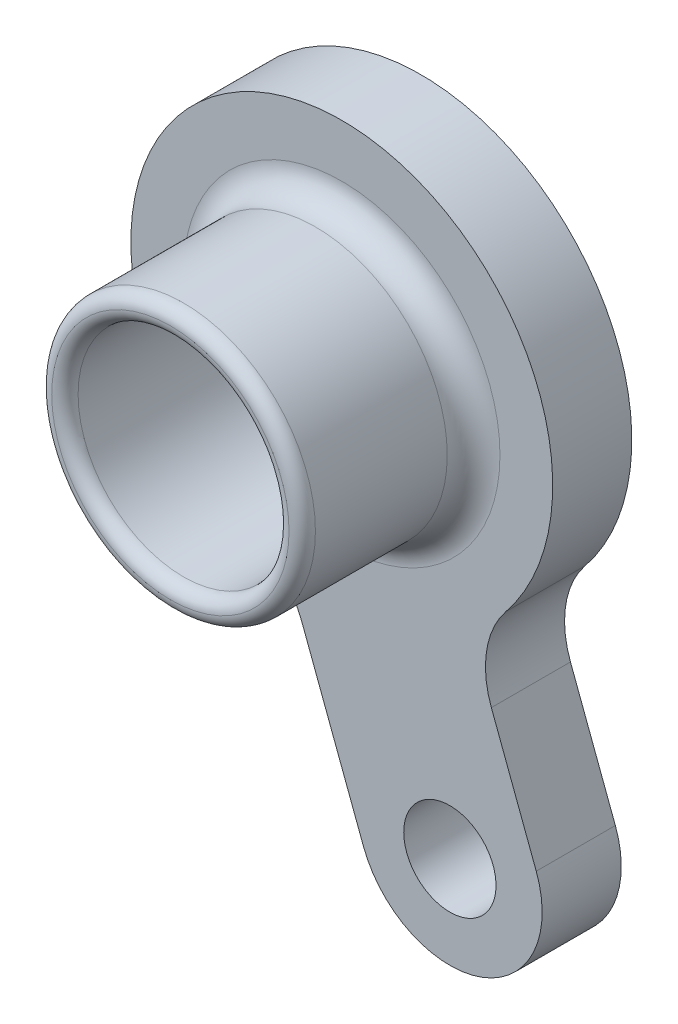
ISO-10303-21;
HEADER;
FILE_DESCRIPTION(('STEP AP214'),'2;1');
FILE_NAME('part.step','',(''),(''),'','','');
FILE_SCHEMA(('AUTOMOTIVE_DESIGN { 1 0 10303 214 1 1 1 1 }'));
ENDSEC;
DATA;
#1=APPLICATION_CONTEXT('core data for automotive mechanical design processes');
#2=APPLICATION_PROTOCOL_DEFINITION('international standard','automotive_design',2000,#1);
#3=PRODUCT_CONTEXT('',#1,'mechanical');
#4=PRODUCT('Part','Part','',(#3));
#5=PRODUCT_RELATED_PRODUCT_CATEGORY('part','',(#4));
#6=PRODUCT_DEFINITION_FORMATION('','',#4);
#7=PRODUCT_DEFINITION_CONTEXT('part definition',#1,'design');
#8=PRODUCT_DEFINITION('design','',#6,#7);
#9=PRODUCT_DEFINITION_SHAPE('','',#8);
#10=(LENGTH_UNIT() NAMED_UNIT(*) SI_UNIT(.MILLI.,.METRE.));
#11=(NAMED_UNIT(*) PLANE_ANGLE_UNIT() SI_UNIT($,.RADIAN.));
#12=(NAMED_UNIT(*) SI_UNIT($,.STERADIAN.) SOLID_ANGLE_UNIT());
#13=UNCERTAINTY_MEASURE_WITH_UNIT(LENGTH_MEASURE(1.E-05),#10,'distance_accuracy_value','');
#14=(GEOMETRIC_REPRESENTATION_CONTEXT(3) GLOBAL_UNCERTAINTY_ASSIGNED_CONTEXT((#13)) GLOBAL_UNIT_ASSIGNED_CONTEXT((#10,
#11,#12)) REPRESENTATION_CONTEXT('',''));
#15=CARTESIAN_POINT('',(0.,0.,0.));
#16=DIRECTION('',(0.,0.,1.));
#17=DIRECTION('',(1.,0.,0.));
#18=AXIS2_PLACEMENT_3D('',#15,#16,#17);
#19=CARTESIAN_POINT('',(0.,0.,3.));
#20=DIRECTION('',(0.,0.,-1.));
#21=DIRECTION('',(-1.,0.,0.));
#22=AXIS2_PLACEMENT_3D('',#19,#20,#21);
#23=CYLINDRICAL_SURFACE('',#22,8.);
#24=CARTESIAN_POINT('',(0.,0.,3.));
#25=DIRECTION('',(0.,0.,1.));
#26=DIRECTION('',(1.,0.,0.));
#27=AXIS2_PLACEMENT_3D('',#24,#25,#26);
#28=CIRCLE('',#27,8.);
#29=CARTESIAN_POINT('',(6.22546666434938,-5.0242974445264,3.));
#30=VERTEX_POINT('',#29);
#31=CARTESIAN_POINT('',(-3.33482549841192,-7.27179062508965,3.));
#32=VERTEX_POINT('',#31);
#33=EDGE_CURVE('E123',#30,#32,#28,.T.);
#34=ORIENTED_EDGE('',*,*,#33,.F.);
#35=DIRECTION('',(0.,0.,-1.));
#36=VECTOR('',#35,1.);
#37=CARTESIAN_POINT('',(6.22546666434938,-5.0242974445264,3.));
#38=LINE('',#37,#36);
#39=CARTESIAN_POINT('',(6.22546666434938,-5.0242974445264,0.));
#40=VERTEX_POINT('',#39);
#41=EDGE_CURVE('E110',#30,#40,#38,.T.);
#42=ORIENTED_EDGE('',*,*,#41,.T.);
#43=CARTESIAN_POINT('',(0.,0.,0.));
#44=DIRECTION('',(0.,0.,1.));
#45=DIRECTION('',(1.,0.,0.));
#46=AXIS2_PLACEMENT_3D('',#43,#44,#45);
#47=CIRCLE('',#46,8.);
#48=CARTESIAN_POINT('',(-3.33482549841192,-7.27179062508965,0.));
#49=VERTEX_POINT('',#48);
#50=EDGE_CURVE('E120',#40,#49,#47,.T.);
#51=ORIENTED_EDGE('',*,*,#50,.T.);
#52=DIRECTION('',(0.,0.,-1.));
#53=VECTOR('',#52,1.);
#54=CARTESIAN_POINT('',(-3.33482549841192,-7.27179062508965,3.));
#55=LINE('',#54,#53);
#56=EDGE_CURVE('E126',#49,#32,#55,.F.);
#57=ORIENTED_EDGE('',*,*,#56,.T.);
#58=EDGE_LOOP('',(#34,#42,#51,#57));
#59=FACE_BOUND('',#58,.T.);
#60=ADVANCED_FACE('F45',(#59),#23,.T.);
#61=CARTESIAN_POINT('',(0.,0.,3.));
#62=DIRECTION('',(0.,0.,-1.));
#63=DIRECTION('',(-1.,0.,0.));
#64=AXIS2_PLACEMENT_3D('',#61,#62,#63);
#65=CYLINDRICAL_SURFACE('',#64,5.);
#66=CARTESIAN_POINT('',(0.,0.,2.25));
#67=DIRECTION('',(0.,0.,1.));
#68=DIRECTION('',(1.,0.,0.));
#69=AXIS2_PLACEMENT_3D('',#66,#67,#68);
#70=CIRCLE('',#69,5.);
#71=CARTESIAN_POINT('',(5.,0.,2.25));
#72=VERTEX_POINT('',#71);
#73=EDGE_CURVE('E154',#72,#72,#70,.T.);
#74=ORIENTED_EDGE('',*,*,#73,.T.);
#75=EDGE_LOOP('',(#74));
#76=FACE_BOUND('',#75,.T.);
#77=CARTESIAN_POINT('',(0.,0.,0.));
#78=DIRECTION('',(0.,0.,1.));
#79=DIRECTION('',(1.,0.,0.));
#80=AXIS2_PLACEMENT_3D('',#77,#78,#79);
#81=CIRCLE('',#80,5.);
#82=CARTESIAN_POINT('',(5.,0.,0.));
#83=VERTEX_POINT('',#82);
#84=EDGE_CURVE('E133',#83,#83,#81,.T.);
#85=ORIENTED_EDGE('',*,*,#84,.F.);
#86=EDGE_LOOP('',(#85));
#87=FACE_BOUND('',#86,.T.);
#88=ADVANCED_FACE('F219',(#76,#87),#65,.F.);
#89=CARTESIAN_POINT('',(0.,0.,3.));
#90=DIRECTION('',(0.,0.,1.));
#91=DIRECTION('',(1.,0.,0.));
#92=AXIS2_PLACEMENT_3D('',#89,#90,#91);
#93=PLANE('',#92);
#94=CARTESIAN_POINT('',(0.,0.,3.));
#95=DIRECTION('',(0.,0.,1.));
#96=DIRECTION('',(1.,0.,0.));
#97=AXIS2_PLACEMENT_3D('',#94,#95,#96);
#98=CIRCLE('',#97,6.);
#99=CARTESIAN_POINT('',(6.,0.,3.));
#100=VERTEX_POINT('',#99);
#101=EDGE_CURVE('E11',#100,#100,#98,.F.);
#102=ORIENTED_EDGE('',*,*,#101,.T.);
#103=EDGE_LOOP('',(#102));
#104=FACE_BOUND('',#103,.T.);
#105=DIRECTION('',(0.352311658541721,-0.935882735846528,0.));
#106=VECTOR('',#105,1.);
#107=CARTESIAN_POINT('',(-4.36985123281011,-1.64502397196093,3.));
#108=LINE('',#107,#106);
#109=CARTESIAN_POINT('',(-1.51822207850429,-9.22010821867035,3.));
#110=VERTEX_POINT('',#109);
#111=CARTESIAN_POINT('',(0.824410424537151,-15.443090804896,3.));
#112=VERTEX_POINT('',#111);
#113=EDGE_CURVE('E278',#110,#112,#108,.T.);
#114=ORIENTED_EDGE('',*,*,#113,.T.);
#115=CARTESIAN_POINT('',(4.1,-14.21,3.));
#116=DIRECTION('',(0.,0.,1.));
#117=DIRECTION('',(1.,0.,0.));
#118=AXIS2_PLACEMENT_3D('',#115,#116,#117);
#119=CIRCLE('',#118,3.5);
#120=CARTESIAN_POINT('',(5.33309080489602,-17.4855895754628,3.));
#121=VERTEX_POINT('',#120);
#122=EDGE_CURVE('E61',#112,#121,#119,.T.);
#123=ORIENTED_EDGE('',*,*,#122,.T.);
#124=CARTESIAN_POINT('',(4.1,-14.21,3.));
#125=DIRECTION('',(0.,0.,1.));
#126=DIRECTION('',(1.,0.,0.));
#127=AXIS2_PLACEMENT_3D('',#124,#125,#126);
#128=CIRCLE('',#127,3.5);
#129=CARTESIAN_POINT('',(7.37558957546285,-12.976909195104,3.));
#130=VERTEX_POINT('',#129);
#131=EDGE_CURVE('E185',#121,#130,#128,.T.);
#132=ORIENTED_EDGE('',*,*,#131,.T.);
#133=DIRECTION('',(-0.352311658541721,0.935882735846528,0.));
#134=VECTOR('',#133,1.);
#135=CARTESIAN_POINT('',(2.18132791811558,0.821157637831119,3.));
#136=LINE('',#135,#134);
#137=CARTESIAN_POINT('',(5.67351875453939,-8.45551838140273,3.));
#138=VERTEX_POINT('',#137);
#139=EDGE_CURVE('E262',#130,#138,#136,.T.);
#140=ORIENTED_EDGE('',*,*,#139,.T.);
#141=CARTESIAN_POINT('',(8.94910833000224,-7.22242757650671,3.));
#142=DIRECTION('',(0.,0.,1.));
#143=DIRECTION('',(1.,0.,0.));
#144=AXIS2_PLACEMENT_3D('',#141,#142,#143);
#145=CIRCLE('',#144,3.5);
#146=EDGE_CURVE('E115',#138,#30,#145,.F.);
#147=ORIENTED_EDGE('',*,*,#146,.T.);
#148=ORIENTED_EDGE('',*,*,#33,.T.);
#149=CARTESIAN_POINT('',(-4.79381165396713,-10.4531990235664,3.));
#150=DIRECTION('',(0.,0.,1.));
#151=DIRECTION('',(1.,0.,0.));
#152=AXIS2_PLACEMENT_3D('',#149,#150,#151);
#153=CIRCLE('',#152,3.5);
#154=EDGE_CURVE('E194',#32,#110,#153,.F.);
#155=ORIENTED_EDGE('',*,*,#154,.T.);
#156=EDGE_LOOP('',(#114,#123,#132,#140,#147,#148,#155));
#157=FACE_BOUND('',#156,.T.);
#158=CARTESIAN_POINT('',(4.1,-14.21,3.));
#159=DIRECTION('',(0.,0.,-1.));
#160=DIRECTION('',(-1.,0.,0.));
#161=AXIS2_PLACEMENT_3D('',#158,#159,#160);
#162=CIRCLE('',#161,1.75);
#163=CARTESIAN_POINT('',(2.35,-14.21,3.));
#164=VERTEX_POINT('',#163);
#165=EDGE_CURVE('E165',#164,#164,#162,.F.);
#166=ORIENTED_EDGE('',*,*,#165,.F.);
#167=EDGE_LOOP('',(#166));
#168=FACE_BOUND('',#167,.T.);
#169=ADVANCED_FACE('F224',(#104,#157,#168),#93,.T.);
#170=CARTESIAN_POINT('',(0.,0.,0.));
#171=DIRECTION('',(0.,0.,1.));
#172=DIRECTION('',(1.,0.,0.));
#173=AXIS2_PLACEMENT_3D('',#170,#171,#172);
#174=PLANE('',#173);
#175=CARTESIAN_POINT('',(4.1,-14.21,0.));
#176=DIRECTION('',(0.,0.,1.));
#177=DIRECTION('',(1.,0.,0.));
#178=AXIS2_PLACEMENT_3D('',#175,#176,#177);
#179=CIRCLE('',#178,3.5);
#180=CARTESIAN_POINT('',(7.37558957546285,-12.976909195104,0.));
#181=VERTEX_POINT('',#180);
#182=CARTESIAN_POINT('',(5.33309080489602,-17.4855895754628,0.));
#183=VERTEX_POINT('',#182);
#184=EDGE_CURVE('E69',#181,#183,#179,.F.);
#185=ORIENTED_EDGE('',*,*,#184,.T.);
#186=CARTESIAN_POINT('',(4.1,-14.21,0.));
#187=DIRECTION('',(0.,0.,1.));
#188=DIRECTION('',(1.,0.,0.));
#189=AXIS2_PLACEMENT_3D('',#186,#187,#188);
#190=CIRCLE('',#189,3.5);
#191=CARTESIAN_POINT('',(0.824410424537151,-15.443090804896,0.));
#192=VERTEX_POINT('',#191);
#193=EDGE_CURVE('E182',#183,#192,#190,.F.);
#194=ORIENTED_EDGE('',*,*,#193,.T.);
#195=DIRECTION('',(0.352311658541721,-0.935882735846528,0.));
#196=VECTOR('',#195,1.);
#197=CARTESIAN_POINT('',(-4.36985123281011,-1.64502397196093,0.));
#198=LINE('',#197,#196);
#199=CARTESIAN_POINT('',(-1.51822207850429,-9.22010821867035,0.));
#200=VERTEX_POINT('',#199);
#201=EDGE_CURVE('E264',#200,#192,#198,.T.);
#202=ORIENTED_EDGE('',*,*,#201,.F.);
#203=CARTESIAN_POINT('',(-4.79381165396713,-10.4531990235664,0.));
#204=DIRECTION('',(0.,0.,1.));
#205=DIRECTION('',(1.,0.,0.));
#206=AXIS2_PLACEMENT_3D('',#203,#204,#205);
#207=CIRCLE('',#206,3.5);
#208=EDGE_CURVE('E131',#200,#49,#207,.T.);
#209=ORIENTED_EDGE('',*,*,#208,.T.);
#210=ORIENTED_EDGE('',*,*,#50,.F.);
#211=CARTESIAN_POINT('',(8.94910833000224,-7.22242757650671,0.));
#212=DIRECTION('',(0.,0.,1.));
#213=DIRECTION('',(1.,0.,0.));
#214=AXIS2_PLACEMENT_3D('',#211,#212,#213);
#215=CIRCLE('',#214,3.5);
#216=CARTESIAN_POINT('',(5.67351875453939,-8.45551838140273,0.));
#217=VERTEX_POINT('',#216);
#218=EDGE_CURVE('E106',#40,#217,#215,.T.);
#219=ORIENTED_EDGE('',*,*,#218,.T.);
#220=DIRECTION('',(-0.352311658541721,0.935882735846528,0.));
#221=VECTOR('',#220,1.);
#222=CARTESIAN_POINT('',(2.18132791811558,0.821157637831119,0.));
#223=LINE('',#222,#221);
#224=EDGE_CURVE('E200',#181,#217,#223,.T.);
#225=ORIENTED_EDGE('',*,*,#224,.F.);
#226=EDGE_LOOP('',(#185,#194,#202,#209,#210,#219,#225));
#227=FACE_BOUND('',#226,.T.);
#228=ORIENTED_EDGE('',*,*,#84,.T.);
#229=EDGE_LOOP('',(#228));
#230=FACE_BOUND('',#229,.T.);
#231=CARTESIAN_POINT('',(4.1,-14.21,0.));
#232=DIRECTION('',(0.,0.,-1.));
#233=DIRECTION('',(-1.,0.,0.));
#234=AXIS2_PLACEMENT_3D('',#231,#232,#233);
#235=CIRCLE('',#234,1.75);
#236=CARTESIAN_POINT('',(2.35,-14.21,0.));
#237=VERTEX_POINT('',#236);
#238=EDGE_CURVE('E268',#237,#237,#235,.F.);
#239=ORIENTED_EDGE('',*,*,#238,.T.);
#240=EDGE_LOOP('',(#239));
#241=FACE_BOUND('',#240,.T.);
#242=ADVANCED_FACE('F128',(#227,#230,#241),#174,.F.);
#243=CARTESIAN_POINT('',(0.,0.,2.75));
#244=DIRECTION('',(0.,0.,1.));
#245=DIRECTION('',(1.,0.,0.));
#246=AXIS2_PLACEMENT_3D('',#243,#244,#245);
#247=CYLINDRICAL_SURFACE('',#246,5.);
#248=CARTESIAN_POINT('',(0.,0.,4.));
#249=DIRECTION('',(0.,0.,1.));
#250=DIRECTION('',(1.,0.,0.));
#251=AXIS2_PLACEMENT_3D('',#248,#249,#250);
#252=CIRCLE('',#251,5.);
#253=CARTESIAN_POINT('',(5.,0.,4.));
#254=VERTEX_POINT('',#253);
#255=EDGE_CURVE('E54',#254,#254,#252,.T.);
#256=ORIENTED_EDGE('',*,*,#255,.T.);
#257=EDGE_LOOP('',(#256));
#258=FACE_BOUND('',#257,.T.);
#259=CARTESIAN_POINT('',(0.,0.,9.));
#260=DIRECTION('',(0.,0.,1.));
#261=DIRECTION('',(1.,0.,0.));
#262=AXIS2_PLACEMENT_3D('',#259,#260,#261);
#263=CIRCLE('',#262,5.);
#264=CARTESIAN_POINT('',(5.,0.,9.));
#265=VERTEX_POINT('',#264);
#266=EDGE_CURVE('E150',#265,#265,#263,.F.);
#267=ORIENTED_EDGE('',*,*,#266,.T.);
#268=EDGE_LOOP('',(#267));
#269=FACE_BOUND('',#268,.T.);
#270=ADVANCED_FACE('F205',(#258,#269),#247,.T.);
#271=CARTESIAN_POINT('',(0.,0.,2.75));
#272=DIRECTION('',(0.,0.,1.));
#273=DIRECTION('',(1.,0.,0.));
#274=AXIS2_PLACEMENT_3D('',#271,#272,#273);
#275=CYLINDRICAL_SURFACE('',#274,4.);
#276=CARTESIAN_POINT('',(0.,0.,9.));
#277=DIRECTION('',(0.,0.,1.));
#278=DIRECTION('',(1.,0.,0.));
#279=AXIS2_PLACEMENT_3D('',#276,#277,#278);
#280=CIRCLE('',#279,4.);
#281=CARTESIAN_POINT('',(4.,0.,9.));
#282=VERTEX_POINT('',#281);
#283=EDGE_CURVE('E146',#282,#282,#280,.T.);
#284=ORIENTED_EDGE('',*,*,#283,.T.);
#285=EDGE_LOOP('',(#284));
#286=FACE_BOUND('',#285,.T.);
#287=CARTESIAN_POINT('',(0.,0.,3.25));
#288=DIRECTION('',(0.,0.,1.));
#289=DIRECTION('',(1.,0.,0.));
#290=AXIS2_PLACEMENT_3D('',#287,#288,#289);
#291=CIRCLE('',#290,4.);
#292=CARTESIAN_POINT('',(4.,0.,3.25));
#293=VERTEX_POINT('',#292);
#294=EDGE_CURVE('E137',#293,#293,#291,.F.);
#295=ORIENTED_EDGE('',*,*,#294,.T.);
#296=EDGE_LOOP('',(#295));
#297=FACE_BOUND('',#296,.T.);
#298=ADVANCED_FACE('F238',(#286,#297),#275,.F.);
#299=CARTESIAN_POINT('',(0.,0.,9.));
#300=DIRECTION('',(0.,0.,1.));
#301=DIRECTION('',(1.,0.,0.));
#302=AXIS2_PLACEMENT_3D('',#299,#300,#301);
#303=TOROIDAL_SURFACE('',#302,4.5,0.5);
#304=ORIENTED_EDGE('',*,*,#266,.F.);
#305=EDGE_LOOP('',(#304));
#306=FACE_BOUND('',#305,.T.);
#307=CARTESIAN_POINT('',(0.,0.,9.5));
#308=DIRECTION('',(0.,0.,1.));
#309=DIRECTION('',(1.,0.,0.));
#310=AXIS2_PLACEMENT_3D('',#307,#308,#309);
#311=CIRCLE('',#310,4.5);
#312=CARTESIAN_POINT('',(4.5,0.,9.5));
#313=VERTEX_POINT('',#312);
#314=EDGE_CURVE('E140',#313,#313,#311,.T.);
#315=ORIENTED_EDGE('',*,*,#314,.F.);
#316=EDGE_LOOP('',(#315));
#317=FACE_BOUND('',#316,.T.);
#318=ADVANCED_FACE('F234',(#306,#317),#303,.T.);
#319=CARTESIAN_POINT('',(0.,0.,9.));
#320=DIRECTION('',(0.,0.,1.));
#321=DIRECTION('',(1.,0.,0.));
#322=AXIS2_PLACEMENT_3D('',#319,#320,#321);
#323=TOROIDAL_SURFACE('',#322,4.5,0.5);
#324=ORIENTED_EDGE('',*,*,#314,.T.);
#325=EDGE_LOOP('',(#324));
#326=FACE_BOUND('',#325,.T.);
#327=ORIENTED_EDGE('',*,*,#283,.F.);
#328=EDGE_LOOP('',(#327));
#329=FACE_BOUND('',#328,.T.);
#330=ADVANCED_FACE('F230',(#326,#329),#323,.T.);
#331=CARTESIAN_POINT('',(0.,0.,2.25));
#332=DIRECTION('',(0.,0.,1.));
#333=DIRECTION('',(1.,0.,0.));
#334=AXIS2_PLACEMENT_3D('',#331,#332,#333);
#335=TOROIDAL_SURFACE('',#334,4.5,0.5);
#336=ORIENTED_EDGE('',*,*,#73,.F.);
#337=EDGE_LOOP('',(#336));
#338=FACE_BOUND('',#337,.T.);
#339=CARTESIAN_POINT('',(0.,0.,2.75));
#340=DIRECTION('',(0.,0.,1.));
#341=DIRECTION('',(1.,0.,0.));
#342=AXIS2_PLACEMENT_3D('',#339,#340,#341);
#343=CIRCLE('',#342,4.5);
#344=CARTESIAN_POINT('',(4.5,0.,2.75));
#345=VERTEX_POINT('',#344);
#346=EDGE_CURVE('E161',#345,#345,#343,.F.);
#347=ORIENTED_EDGE('',*,*,#346,.F.);
#348=EDGE_LOOP('',(#347));
#349=FACE_BOUND('',#348,.T.);
#350=ADVANCED_FACE('F233',(#338,#349),#335,.F.);
#351=CARTESIAN_POINT('',(0.,0.,3.25));
#352=DIRECTION('',(0.,0.,1.));
#353=DIRECTION('',(1.,0.,0.));
#354=AXIS2_PLACEMENT_3D('',#351,#352,#353);
#355=TOROIDAL_SURFACE('',#354,4.5,0.5);
#356=ORIENTED_EDGE('',*,*,#294,.F.);
#357=EDGE_LOOP('',(#356));
#358=FACE_BOUND('',#357,.T.);
#359=ORIENTED_EDGE('',*,*,#346,.T.);
#360=EDGE_LOOP('',(#359));
#361=FACE_BOUND('',#360,.T.);
#362=ADVANCED_FACE('F240',(#358,#361),#355,.T.);
#363=CARTESIAN_POINT('',(2.18132791811558,0.821157637831119,3.));
#364=DIRECTION('',(-0.935882735846528,-0.352311658541721,0.));
#365=DIRECTION('',(0.352311658541721,-0.935882735846528,0.));
#366=AXIS2_PLACEMENT_3D('',#363,#364,#365);
#367=PLANE('',#366);
#368=ORIENTED_EDGE('',*,*,#224,.T.);
#369=DIRECTION('',(0.,0.,1.));
#370=VECTOR('',#369,1.);
#371=CARTESIAN_POINT('',(5.67351875453939,-8.45551838140273,3.));
#372=LINE('',#371,#370);
#373=EDGE_CURVE('E111',#217,#138,#372,.T.);
#374=ORIENTED_EDGE('',*,*,#373,.T.);
#375=ORIENTED_EDGE('',*,*,#139,.F.);
#376=DIRECTION('',(0.,0.,-1.));
#377=VECTOR('',#376,1.);
#378=CARTESIAN_POINT('',(7.37558957546285,-12.976909195104,3.));
#379=LINE('',#378,#377);
#380=EDGE_CURVE('E125',#130,#181,#379,.T.);
#381=ORIENTED_EDGE('',*,*,#380,.T.);
#382=EDGE_LOOP('',(#368,#374,#375,#381));
#383=FACE_BOUND('',#382,.T.);
#384=ADVANCED_FACE('F243',(#383),#367,.F.);
#385=CARTESIAN_POINT('',(-4.36985123281011,-1.64502397196093,3.));
#386=DIRECTION('',(0.935882735846528,0.352311658541721,0.));
#387=DIRECTION('',(-0.352311658541721,0.935882735846528,0.));
#388=AXIS2_PLACEMENT_3D('',#385,#386,#387);
#389=PLANE('',#388);
#390=ORIENTED_EDGE('',*,*,#113,.F.);
#391=DIRECTION('',(0.,0.,1.));
#392=VECTOR('',#391,1.);
#393=CARTESIAN_POINT('',(-1.51822207850429,-9.22010821867035,0.));
#394=LINE('',#393,#392);
#395=EDGE_CURVE('E176',#110,#200,#394,.F.);
#396=ORIENTED_EDGE('',*,*,#395,.T.);
#397=ORIENTED_EDGE('',*,*,#201,.T.);
#398=DIRECTION('',(0.,0.,-1.));
#399=VECTOR('',#398,1.);
#400=CARTESIAN_POINT('',(0.824410424537149,-15.443090804896,3.));
#401=LINE('',#400,#399);
#402=EDGE_CURVE('E172',#192,#112,#401,.F.);
#403=ORIENTED_EDGE('',*,*,#402,.T.);
#404=EDGE_LOOP('',(#390,#396,#397,#403));
#405=FACE_BOUND('',#404,.T.);
#406=ADVANCED_FACE('F301',(#405),#389,.F.);
#407=CARTESIAN_POINT('',(4.1,-14.21,3.));
#408=DIRECTION('',(0.,0.,-1.));
#409=DIRECTION('',(-1.,0.,0.));
#410=AXIS2_PLACEMENT_3D('',#407,#408,#409);
#411=CYLINDRICAL_SURFACE('',#410,1.75);
#412=ORIENTED_EDGE('',*,*,#165,.T.);
#413=EDGE_LOOP('',(#412));
#414=FACE_BOUND('',#413,.T.);
#415=ORIENTED_EDGE('',*,*,#238,.F.);
#416=EDGE_LOOP('',(#415));
#417=FACE_BOUND('',#416,.T.);
#418=ADVANCED_FACE('F251',(#414,#417),#411,.F.);
#419=CARTESIAN_POINT('',(8.94910833000224,-7.22242757650671,3.));
#420=DIRECTION('',(0.,0.,-1.));
#421=DIRECTION('',(-1.,0.,0.));
#422=AXIS2_PLACEMENT_3D('',#419,#420,#421);
#423=CYLINDRICAL_SURFACE('',#422,3.5);
#424=ORIENTED_EDGE('',*,*,#146,.F.);
#425=ORIENTED_EDGE('',*,*,#373,.F.);
#426=ORIENTED_EDGE('',*,*,#218,.F.);
#427=ORIENTED_EDGE('',*,*,#41,.F.);
#428=EDGE_LOOP('',(#424,#425,#426,#427));
#429=FACE_BOUND('',#428,.T.);
#430=ADVANCED_FACE('F109',(#429),#423,.F.);
#431=CARTESIAN_POINT('',(-4.79381165396713,-10.4531990235664,3.));
#432=DIRECTION('',(0.,0.,-1.));
#433=DIRECTION('',(-1.,0.,0.));
#434=AXIS2_PLACEMENT_3D('',#431,#432,#433);
#435=CYLINDRICAL_SURFACE('',#434,3.5);
#436=ORIENTED_EDGE('',*,*,#154,.F.);
#437=ORIENTED_EDGE('',*,*,#56,.F.);
#438=ORIENTED_EDGE('',*,*,#208,.F.);
#439=ORIENTED_EDGE('',*,*,#395,.F.);
#440=EDGE_LOOP('',(#436,#437,#438,#439));
#441=FACE_BOUND('',#440,.T.);
#442=ADVANCED_FACE('F250',(#441),#435,.F.);
#443=CARTESIAN_POINT('',(4.1,-14.21,3.));
#444=DIRECTION('',(0.,0.,-1.));
#445=DIRECTION('',(-1.,0.,0.));
#446=AXIS2_PLACEMENT_3D('',#443,#444,#445);
#447=CYLINDRICAL_SURFACE('',#446,3.5);
#448=ORIENTED_EDGE('',*,*,#380,.F.);
#449=ORIENTED_EDGE('',*,*,#131,.F.);
#450=DIRECTION('',(0.,0.,-1.));
#451=VECTOR('',#450,1.);
#452=CARTESIAN_POINT('',(5.33309080489602,-17.4855895754628,3.));
#453=LINE('',#452,#451);
#454=EDGE_CURVE('E197',#183,#121,#453,.F.);
#455=ORIENTED_EDGE('',*,*,#454,.F.);
#456=ORIENTED_EDGE('',*,*,#184,.F.);
#457=EDGE_LOOP('',(#448,#449,#455,#456));
#458=FACE_BOUND('',#457,.T.);
#459=ADVANCED_FACE('F214',(#458),#447,.T.);
#460=CARTESIAN_POINT('',(4.1,-14.21,3.));
#461=DIRECTION('',(0.,0.,-1.));
#462=DIRECTION('',(-1.,0.,0.));
#463=AXIS2_PLACEMENT_3D('',#460,#461,#462);
#464=CYLINDRICAL_SURFACE('',#463,3.5);
#465=ORIENTED_EDGE('',*,*,#122,.F.);
#466=ORIENTED_EDGE('',*,*,#402,.F.);
#467=ORIENTED_EDGE('',*,*,#193,.F.);
#468=ORIENTED_EDGE('',*,*,#454,.T.);
#469=EDGE_LOOP('',(#465,#466,#467,#468));
#470=FACE_BOUND('',#469,.T.);
#471=ADVANCED_FACE('F209',(#470),#464,.T.);
#472=CARTESIAN_POINT('',(0.,0.,4.));
#473=DIRECTION('',(0.,0.,1.));
#474=DIRECTION('',(1.,0.,0.));
#475=AXIS2_PLACEMENT_3D('',#472,#473,#474);
#476=TOROIDAL_SURFACE('',#475,6.,1.);
#477=ORIENTED_EDGE('',*,*,#101,.F.);
#478=EDGE_LOOP('',(#477));
#479=FACE_BOUND('',#478,.T.);
#480=ORIENTED_EDGE('',*,*,#255,.F.);
#481=EDGE_LOOP('',(#480));
#482=FACE_BOUND('',#481,.T.);
#483=ADVANCED_FACE('F47',(#479,#482),#476,.F.);
#484=CLOSED_SHELL('',(#60,#88,#169,#242,#270,#298,#318,#330,#350,#362,#384,#406,#418,#430,#442,
#459,#471,#483));
#485=MANIFOLD_SOLID_BREP('B2',#484);
#486=ADVANCED_BREP_SHAPE_REPRESENTATION('',(#18,#485),#14);
#487=SHAPE_DEFINITION_REPRESENTATION(#9,#486);
ENDSEC;
END-ISO-10303-21;
